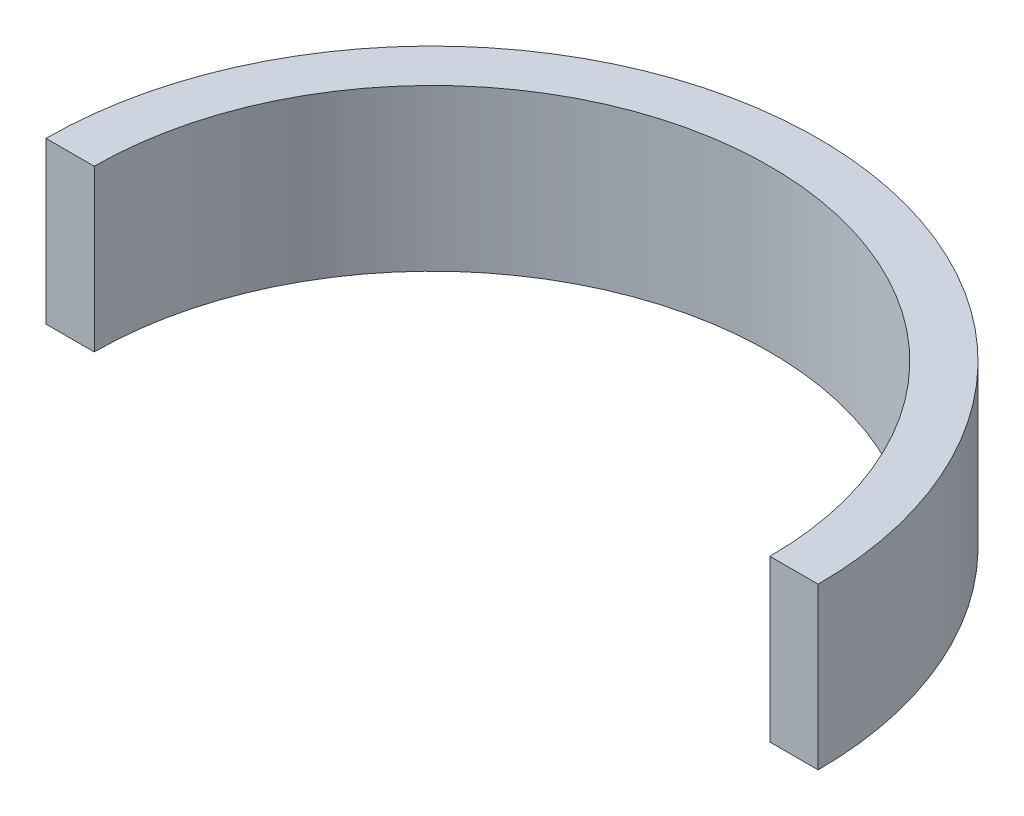
ISO-10303-21;
HEADER;
FILE_DESCRIPTION(('STEP AP214'),'2;1');
FILE_NAME('part.step','',(''),(''),'','','');
FILE_SCHEMA(('AUTOMOTIVE_DESIGN { 1 0 10303 214 1 1 1 1 }'));
ENDSEC;
DATA;
#1=APPLICATION_CONTEXT('core data for automotive mechanical design processes');
#2=APPLICATION_PROTOCOL_DEFINITION('international standard','automotive_design',2000,#1);
#3=PRODUCT_CONTEXT('',#1,'mechanical');
#4=PRODUCT('Part','Part','',(#3));
#5=PRODUCT_RELATED_PRODUCT_CATEGORY('part','',(#4));
#6=PRODUCT_DEFINITION_FORMATION('','',#4);
#7=PRODUCT_DEFINITION_CONTEXT('part definition',#1,'design');
#8=PRODUCT_DEFINITION('design','',#6,#7);
#9=PRODUCT_DEFINITION_SHAPE('','',#8);
#10=(LENGTH_UNIT() NAMED_UNIT(*) SI_UNIT(.MILLI.,.METRE.));
#11=(NAMED_UNIT(*) PLANE_ANGLE_UNIT() SI_UNIT($,.RADIAN.));
#12=(NAMED_UNIT(*) SI_UNIT($,.STERADIAN.) SOLID_ANGLE_UNIT());
#13=UNCERTAINTY_MEASURE_WITH_UNIT(LENGTH_MEASURE(1.E-05),#10,'distance_accuracy_value','');
#14=(GEOMETRIC_REPRESENTATION_CONTEXT(3) GLOBAL_UNCERTAINTY_ASSIGNED_CONTEXT((#13)) GLOBAL_UNIT_ASSIGNED_CONTEXT((#10,
#11,#12)) REPRESENTATION_CONTEXT('',''));
#15=CARTESIAN_POINT('',(0.,0.,0.));
#16=DIRECTION('',(0.,0.,1.));
#17=DIRECTION('',(1.,0.,0.));
#18=AXIS2_PLACEMENT_3D('',#15,#16,#17);
#19=CARTESIAN_POINT('',(0.,20.,0.));
#20=DIRECTION('',(0.,-1.,0.));
#21=DIRECTION('',(0.,0.,-1.));
#22=AXIS2_PLACEMENT_3D('',#19,#20,#21);
#23=CYLINDRICAL_SURFACE('',#22,42.);
#24=CARTESIAN_POINT('',(0.,0.,0.));
#25=DIRECTION('',(0.,-1.,0.));
#26=DIRECTION('',(0.,0.,1.));
#27=AXIS2_PLACEMENT_3D('',#24,#25,#26);
#28=CIRCLE('',#27,42.);
#29=CARTESIAN_POINT('',(-42.,0.,0.));
#30=VERTEX_POINT('',#29);
#31=CARTESIAN_POINT('',(42.,0.,0.));
#32=VERTEX_POINT('',#31);
#33=EDGE_CURVE('E97',#30,#32,#28,.T.);
#34=ORIENTED_EDGE('',*,*,#33,.T.);
#35=DIRECTION('',(0.,-1.,0.));
#36=VECTOR('',#35,1.);
#37=CARTESIAN_POINT('',(42.,20.,0.));
#38=LINE('',#37,#36);
#39=CARTESIAN_POINT('',(42.,20.,0.));
#40=VERTEX_POINT('',#39);
#41=EDGE_CURVE('E11',#40,#32,#38,.T.);
#42=ORIENTED_EDGE('',*,*,#41,.F.);
#43=CARTESIAN_POINT('',(0.,20.,0.));
#44=DIRECTION('',(0.,-1.,0.));
#45=DIRECTION('',(0.,0.,1.));
#46=AXIS2_PLACEMENT_3D('',#43,#44,#45);
#47=CIRCLE('',#46,42.);
#48=CARTESIAN_POINT('',(-42.,20.,0.));
#49=VERTEX_POINT('',#48);
#50=EDGE_CURVE('E85',#49,#40,#47,.T.);
#51=ORIENTED_EDGE('',*,*,#50,.F.);
#52=DIRECTION('',(0.,-1.,0.));
#53=VECTOR('',#52,1.);
#54=CARTESIAN_POINT('',(-42.,20.,0.));
#55=LINE('',#54,#53);
#56=EDGE_CURVE('E93',#49,#30,#55,.T.);
#57=ORIENTED_EDGE('',*,*,#56,.T.);
#58=EDGE_LOOP('',(#34,#42,#51,#57));
#59=FACE_BOUND('',#58,.T.);
#60=ADVANCED_FACE('F34',(#59),#23,.F.);
#61=CARTESIAN_POINT('',(42.,20.,0.));
#62=DIRECTION('',(0.,0.,-1.));
#63=DIRECTION('',(-1.,0.,0.));
#64=AXIS2_PLACEMENT_3D('',#61,#62,#63);
#65=PLANE('',#64);
#66=DIRECTION('',(1.,0.,0.));
#67=VECTOR('',#66,1.);
#68=CARTESIAN_POINT('',(42.,0.,0.));
#69=LINE('',#68,#67);
#70=CARTESIAN_POINT('',(48.,0.,0.));
#71=VERTEX_POINT('',#70);
#72=EDGE_CURVE('E89',#32,#71,#69,.T.);
#73=ORIENTED_EDGE('',*,*,#72,.T.);
#74=DIRECTION('',(0.,-1.,0.));
#75=VECTOR('',#74,1.);
#76=CARTESIAN_POINT('',(48.,20.,0.));
#77=LINE('',#76,#75);
#78=CARTESIAN_POINT('',(48.,20.,0.));
#79=VERTEX_POINT('',#78);
#80=EDGE_CURVE('E42',#79,#71,#77,.T.);
#81=ORIENTED_EDGE('',*,*,#80,.F.);
#82=DIRECTION('',(1.,0.,0.));
#83=VECTOR('',#82,1.);
#84=CARTESIAN_POINT('',(42.,20.,0.));
#85=LINE('',#84,#83);
#86=EDGE_CURVE('E80',#40,#79,#85,.T.);
#87=ORIENTED_EDGE('',*,*,#86,.F.);
#88=ORIENTED_EDGE('',*,*,#41,.T.);
#89=EDGE_LOOP('',(#73,#81,#87,#88));
#90=FACE_BOUND('',#89,.T.);
#91=ADVANCED_FACE('F88',(#90),#65,.F.);
#92=CARTESIAN_POINT('',(0.,20.,0.));
#93=DIRECTION('',(0.,-1.,0.));
#94=DIRECTION('',(0.,0.,-1.));
#95=AXIS2_PLACEMENT_3D('',#92,#93,#94);
#96=CYLINDRICAL_SURFACE('',#95,48.);
#97=CARTESIAN_POINT('',(0.,0.,0.));
#98=DIRECTION('',(0.,1.,0.));
#99=DIRECTION('',(0.,0.,1.));
#100=AXIS2_PLACEMENT_3D('',#97,#98,#99);
#101=CIRCLE('',#100,48.);
#102=CARTESIAN_POINT('',(-48.,0.,0.));
#103=VERTEX_POINT('',#102);
#104=EDGE_CURVE('E67',#71,#103,#101,.T.);
#105=ORIENTED_EDGE('',*,*,#104,.T.);
#106=DIRECTION('',(0.,-1.,0.));
#107=VECTOR('',#106,1.);
#108=CARTESIAN_POINT('',(-48.,20.,0.));
#109=LINE('',#108,#107);
#110=CARTESIAN_POINT('',(-48.,20.,0.));
#111=VERTEX_POINT('',#110);
#112=EDGE_CURVE('E90',#111,#103,#109,.T.);
#113=ORIENTED_EDGE('',*,*,#112,.F.);
#114=CARTESIAN_POINT('',(0.,20.,0.));
#115=DIRECTION('',(0.,1.,0.));
#116=DIRECTION('',(0.,0.,1.));
#117=AXIS2_PLACEMENT_3D('',#114,#115,#116);
#118=CIRCLE('',#117,48.);
#119=EDGE_CURVE('E83',#79,#111,#118,.T.);
#120=ORIENTED_EDGE('',*,*,#119,.F.);
#121=ORIENTED_EDGE('',*,*,#80,.T.);
#122=EDGE_LOOP('',(#105,#113,#120,#121));
#123=FACE_BOUND('',#122,.T.);
#124=ADVANCED_FACE('F91',(#123),#96,.T.);
#125=CARTESIAN_POINT('',(-48.,20.,0.));
#126=DIRECTION('',(0.,0.,-1.));
#127=DIRECTION('',(-1.,0.,0.));
#128=AXIS2_PLACEMENT_3D('',#125,#126,#127);
#129=PLANE('',#128);
#130=DIRECTION('',(1.,0.,0.));
#131=VECTOR('',#130,1.);
#132=CARTESIAN_POINT('',(-48.,0.,0.));
#133=LINE('',#132,#131);
#134=EDGE_CURVE('E73',#103,#30,#133,.T.);
#135=ORIENTED_EDGE('',*,*,#134,.T.);
#136=ORIENTED_EDGE('',*,*,#56,.F.);
#137=DIRECTION('',(1.,0.,0.));
#138=VECTOR('',#137,1.);
#139=CARTESIAN_POINT('',(-48.,20.,0.));
#140=LINE('',#139,#138);
#141=EDGE_CURVE('E50',#111,#49,#140,.T.);
#142=ORIENTED_EDGE('',*,*,#141,.F.);
#143=ORIENTED_EDGE('',*,*,#112,.T.);
#144=EDGE_LOOP('',(#135,#136,#142,#143));
#145=FACE_BOUND('',#144,.T.);
#146=ADVANCED_FACE('F104',(#145),#129,.F.);
#147=CARTESIAN_POINT('',(0.,20.,0.));
#148=DIRECTION('',(0.,1.,0.));
#149=DIRECTION('',(0.,0.,1.));
#150=AXIS2_PLACEMENT_3D('',#147,#148,#149);
#151=PLANE('',#150);
#152=ORIENTED_EDGE('',*,*,#50,.T.);
#153=ORIENTED_EDGE('',*,*,#86,.T.);
#154=ORIENTED_EDGE('',*,*,#119,.T.);
#155=ORIENTED_EDGE('',*,*,#141,.T.);
#156=EDGE_LOOP('',(#152,#153,#154,#155));
#157=FACE_BOUND('',#156,.T.);
#158=ADVANCED_FACE('F81',(#157),#151,.T.);
#159=CARTESIAN_POINT('',(0.,0.,0.));
#160=DIRECTION('',(0.,1.,0.));
#161=DIRECTION('',(0.,0.,1.));
#162=AXIS2_PLACEMENT_3D('',#159,#160,#161);
#163=PLANE('',#162);
#164=ORIENTED_EDGE('',*,*,#33,.F.);
#165=ORIENTED_EDGE('',*,*,#134,.F.);
#166=ORIENTED_EDGE('',*,*,#104,.F.);
#167=ORIENTED_EDGE('',*,*,#72,.F.);
#168=EDGE_LOOP('',(#164,#165,#166,#167));
#169=FACE_BOUND('',#168,.T.);
#170=ADVANCED_FACE('F107',(#169),#163,.F.);
#171=CLOSED_SHELL('',(#60,#91,#124,#146,#158,#170));
#172=MANIFOLD_SOLID_BREP('B2',#171);
#173=ADVANCED_BREP_SHAPE_REPRESENTATION('',(#18,#172),#14);
#174=SHAPE_DEFINITION_REPRESENTATION(#9,#173);
ENDSEC;
END-ISO-10303-21;
